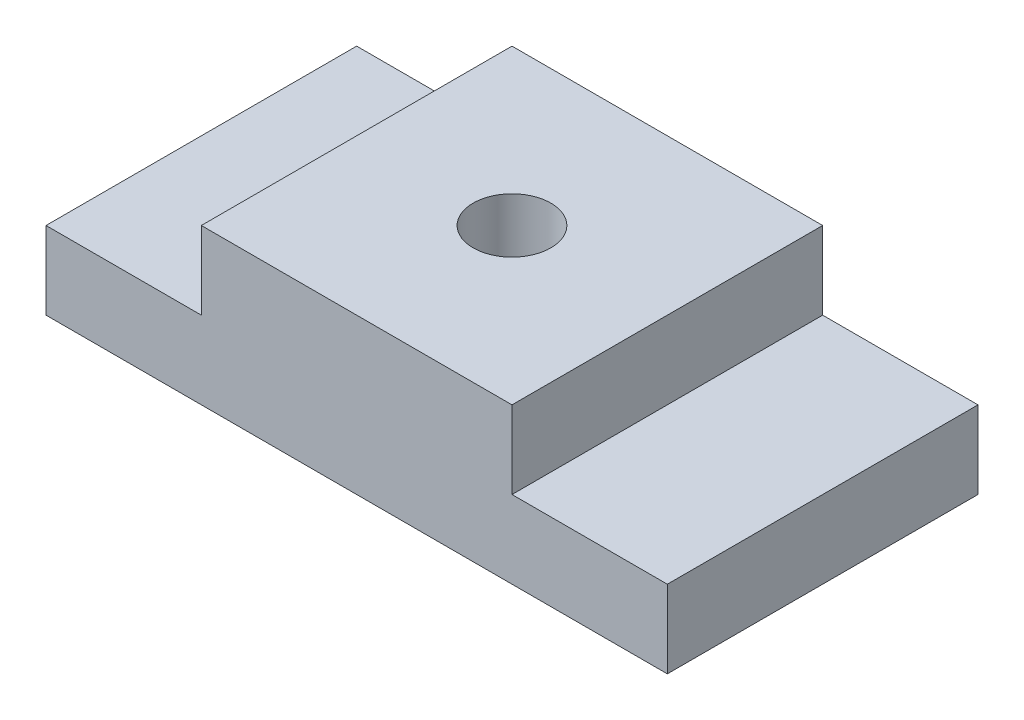
ISO-10303-21;
HEADER;
FILE_DESCRIPTION(('STEP AP214'),'2;1');
FILE_NAME('part.step','',(''),(''),'','','');
FILE_SCHEMA(('AUTOMOTIVE_DESIGN { 1 0 10303 214 1 1 1 1 }'));
ENDSEC;
DATA;
#1=APPLICATION_CONTEXT('core data for automotive mechanical design processes');
#2=APPLICATION_PROTOCOL_DEFINITION('international standard','automotive_design',2000,#1);
#3=PRODUCT_CONTEXT('',#1,'mechanical');
#4=PRODUCT('Part','Part','',(#3));
#5=PRODUCT_RELATED_PRODUCT_CATEGORY('part','',(#4));
#6=PRODUCT_DEFINITION_FORMATION('','',#4);
#7=PRODUCT_DEFINITION_CONTEXT('part definition',#1,'design');
#8=PRODUCT_DEFINITION('design','',#6,#7);
#9=PRODUCT_DEFINITION_SHAPE('','',#8);
#10=(LENGTH_UNIT() NAMED_UNIT(*) SI_UNIT(.MILLI.,.METRE.));
#11=(NAMED_UNIT(*) PLANE_ANGLE_UNIT() SI_UNIT($,.RADIAN.));
#12=(NAMED_UNIT(*) SI_UNIT($,.STERADIAN.) SOLID_ANGLE_UNIT());
#13=UNCERTAINTY_MEASURE_WITH_UNIT(LENGTH_MEASURE(1.E-05),#10,'distance_accuracy_value','');
#14=(GEOMETRIC_REPRESENTATION_CONTEXT(3) GLOBAL_UNCERTAINTY_ASSIGNED_CONTEXT((#13)) GLOBAL_UNIT_ASSIGNED_CONTEXT((#10,
#11,#12)) REPRESENTATION_CONTEXT('',''));
#15=CARTESIAN_POINT('',(0.,0.,0.));
#16=DIRECTION('',(0.,0.,1.));
#17=DIRECTION('',(1.,0.,0.));
#18=AXIS2_PLACEMENT_3D('',#15,#16,#17);
#19=CARTESIAN_POINT('',(0.,10.,0.));
#20=DIRECTION('',(0.,-1.,0.));
#21=DIRECTION('',(0.,0.,-1.));
#22=AXIS2_PLACEMENT_3D('',#19,#20,#21);
#23=PLANE('',#22);
#24=DIRECTION('',(0.,0.,-1.));
#25=VECTOR('',#24,1.);
#26=CARTESIAN_POINT('',(20.,10.,20.));
#27=LINE('',#26,#25);
#28=CARTESIAN_POINT('',(20.,10.,20.));
#29=VERTEX_POINT('',#28);
#30=CARTESIAN_POINT('',(20.,10.,-20.));
#31=VERTEX_POINT('',#30);
#32=EDGE_CURVE('E55',#29,#31,#27,.T.);
#33=ORIENTED_EDGE('',*,*,#32,.F.);
#34=DIRECTION('',(1.,0.,0.));
#35=VECTOR('',#34,1.);
#36=CARTESIAN_POINT('',(-40.,10.,20.));
#37=LINE('',#36,#35);
#38=CARTESIAN_POINT('',(40.,10.,20.));
#39=VERTEX_POINT('',#38);
#40=EDGE_CURVE('E152',#29,#39,#37,.T.);
#41=ORIENTED_EDGE('',*,*,#40,.T.);
#42=DIRECTION('',(0.,0.,-1.));
#43=VECTOR('',#42,1.);
#44=CARTESIAN_POINT('',(40.,10.,20.));
#45=LINE('',#44,#43);
#46=CARTESIAN_POINT('',(40.,10.,-20.));
#47=VERTEX_POINT('',#46);
#48=EDGE_CURVE('E140',#39,#47,#45,.T.);
#49=ORIENTED_EDGE('',*,*,#48,.T.);
#50=DIRECTION('',(-1.,0.,0.));
#51=VECTOR('',#50,1.);
#52=CARTESIAN_POINT('',(-40.,10.,-20.));
#53=LINE('',#52,#51);
#54=EDGE_CURVE('E146',#47,#31,#53,.T.);
#55=ORIENTED_EDGE('',*,*,#54,.T.);
#56=EDGE_LOOP('',(#33,#41,#49,#55));
#57=FACE_BOUND('',#56,.T.);
#58=ADVANCED_FACE('F39',(#57),#23,.F.);
#59=DIRECTION('',(0.,0.,1.));
#60=VECTOR('',#59,1.);
#61=CARTESIAN_POINT('',(-20.,10.,20.));
#62=LINE('',#61,#60);
#63=CARTESIAN_POINT('',(-20.,10.,-20.));
#64=VERTEX_POINT('',#63);
#65=CARTESIAN_POINT('',(-20.,10.,20.));
#66=VERTEX_POINT('',#65);
#67=EDGE_CURVE('E63',#64,#66,#62,.T.);
#68=ORIENTED_EDGE('',*,*,#67,.F.);
#69=CARTESIAN_POINT('',(-40.,10.,-20.));
#70=VERTEX_POINT('',#69);
#71=EDGE_CURVE('E144',#64,#70,#53,.T.);
#72=ORIENTED_EDGE('',*,*,#71,.T.);
#73=DIRECTION('',(0.,0.,1.));
#74=VECTOR('',#73,1.);
#75=CARTESIAN_POINT('',(-40.,10.,20.));
#76=LINE('',#75,#74);
#77=CARTESIAN_POINT('',(-40.,10.,20.));
#78=VERTEX_POINT('',#77);
#79=EDGE_CURVE('E149',#70,#78,#76,.T.);
#80=ORIENTED_EDGE('',*,*,#79,.T.);
#81=EDGE_CURVE('E153',#78,#66,#37,.T.);
#82=ORIENTED_EDGE('',*,*,#81,.T.);
#83=EDGE_LOOP('',(#68,#72,#80,#82));
#84=FACE_BOUND('',#83,.T.);
#85=ADVANCED_FACE('F191',(#84),#23,.F.);
#86=CARTESIAN_POINT('',(40.,10.,20.));
#87=DIRECTION('',(-1.,0.,0.));
#88=DIRECTION('',(0.,0.,1.));
#89=AXIS2_PLACEMENT_3D('',#86,#87,#88);
#90=PLANE('',#89);
#91=DIRECTION('',(0.,0.,-1.));
#92=VECTOR('',#91,1.);
#93=CARTESIAN_POINT('',(40.,0.,20.));
#94=LINE('',#93,#92);
#95=CARTESIAN_POINT('',(40.,0.,20.));
#96=VERTEX_POINT('',#95);
#97=CARTESIAN_POINT('',(40.,0.,-20.));
#98=VERTEX_POINT('',#97);
#99=EDGE_CURVE('E129',#96,#98,#94,.T.);
#100=ORIENTED_EDGE('',*,*,#99,.T.);
#101=DIRECTION('',(0.,-1.,0.));
#102=VECTOR('',#101,1.);
#103=CARTESIAN_POINT('',(40.,10.,-20.));
#104=LINE('',#103,#102);
#105=EDGE_CURVE('E11',#47,#98,#104,.T.);
#106=ORIENTED_EDGE('',*,*,#105,.F.);
#107=ORIENTED_EDGE('',*,*,#48,.F.);
#108=DIRECTION('',(0.,-1.,0.));
#109=VECTOR('',#108,1.);
#110=CARTESIAN_POINT('',(40.,10.,20.));
#111=LINE('',#110,#109);
#112=EDGE_CURVE('E155',#39,#96,#111,.T.);
#113=ORIENTED_EDGE('',*,*,#112,.T.);
#114=EDGE_LOOP('',(#100,#106,#107,#113));
#115=FACE_BOUND('',#114,.T.);
#116=ADVANCED_FACE('F41',(#115),#90,.F.);
#117=CARTESIAN_POINT('',(-40.,10.,-20.));
#118=DIRECTION('',(0.,0.,1.));
#119=DIRECTION('',(1.,0.,0.));
#120=AXIS2_PLACEMENT_3D('',#117,#118,#119);
#121=PLANE('',#120);
#122=DIRECTION('',(-1.,0.,0.));
#123=VECTOR('',#122,1.);
#124=CARTESIAN_POINT('',(-40.,0.,-20.));
#125=LINE('',#124,#123);
#126=CARTESIAN_POINT('',(-40.,0.,-20.));
#127=VERTEX_POINT('',#126);
#128=EDGE_CURVE('E134',#98,#127,#125,.T.);
#129=ORIENTED_EDGE('',*,*,#128,.T.);
#130=DIRECTION('',(0.,-1.,0.));
#131=VECTOR('',#130,1.);
#132=CARTESIAN_POINT('',(-40.,10.,-20.));
#133=LINE('',#132,#131);
#134=EDGE_CURVE('E48',#70,#127,#133,.T.);
#135=ORIENTED_EDGE('',*,*,#134,.F.);
#136=ORIENTED_EDGE('',*,*,#71,.F.);
#137=DIRECTION('',(0.,-1.,0.));
#138=VECTOR('',#137,1.);
#139=CARTESIAN_POINT('',(-20.,20.,-20.));
#140=LINE('',#139,#138);
#141=CARTESIAN_POINT('',(-20.,20.,-20.));
#142=VERTEX_POINT('',#141);
#143=EDGE_CURVE('E111',#142,#64,#140,.T.);
#144=ORIENTED_EDGE('',*,*,#143,.F.);
#145=DIRECTION('',(-1.,0.,0.));
#146=VECTOR('',#145,1.);
#147=CARTESIAN_POINT('',(-20.,20.,-20.));
#148=LINE('',#147,#146);
#149=CARTESIAN_POINT('',(20.,20.,-20.));
#150=VERTEX_POINT('',#149);
#151=EDGE_CURVE('E105',#150,#142,#148,.T.);
#152=ORIENTED_EDGE('',*,*,#151,.F.);
#153=DIRECTION('',(0.,-1.,0.));
#154=VECTOR('',#153,1.);
#155=CARTESIAN_POINT('',(20.,20.,-20.));
#156=LINE('',#155,#154);
#157=EDGE_CURVE('E109',#150,#31,#156,.T.);
#158=ORIENTED_EDGE('',*,*,#157,.T.);
#159=ORIENTED_EDGE('',*,*,#54,.F.);
#160=ORIENTED_EDGE('',*,*,#105,.T.);
#161=EDGE_LOOP('',(#129,#135,#136,#144,#152,#158,#159,#160));
#162=FACE_BOUND('',#161,.T.);
#163=ADVANCED_FACE('F107',(#162),#121,.F.);
#164=CARTESIAN_POINT('',(-40.,10.,20.));
#165=DIRECTION('',(1.,0.,0.));
#166=DIRECTION('',(0.,0.,-1.));
#167=AXIS2_PLACEMENT_3D('',#164,#165,#166);
#168=PLANE('',#167);
#169=DIRECTION('',(0.,0.,1.));
#170=VECTOR('',#169,1.);
#171=CARTESIAN_POINT('',(-40.,0.,20.));
#172=LINE('',#171,#170);
#173=CARTESIAN_POINT('',(-40.,0.,20.));
#174=VERTEX_POINT('',#173);
#175=EDGE_CURVE('E159',#127,#174,#172,.T.);
#176=ORIENTED_EDGE('',*,*,#175,.T.);
#177=DIRECTION('',(0.,-1.,0.));
#178=VECTOR('',#177,1.);
#179=CARTESIAN_POINT('',(-40.,10.,20.));
#180=LINE('',#179,#178);
#181=EDGE_CURVE('E167',#78,#174,#180,.T.);
#182=ORIENTED_EDGE('',*,*,#181,.F.);
#183=ORIENTED_EDGE('',*,*,#79,.F.);
#184=ORIENTED_EDGE('',*,*,#134,.T.);
#185=EDGE_LOOP('',(#176,#182,#183,#184));
#186=FACE_BOUND('',#185,.T.);
#187=ADVANCED_FACE('F176',(#186),#168,.F.);
#188=CARTESIAN_POINT('',(-40.,10.,20.));
#189=DIRECTION('',(0.,0.,-1.));
#190=DIRECTION('',(-1.,0.,0.));
#191=AXIS2_PLACEMENT_3D('',#188,#189,#190);
#192=PLANE('',#191);
#193=DIRECTION('',(1.,0.,0.));
#194=VECTOR('',#193,1.);
#195=CARTESIAN_POINT('',(-40.,0.,20.));
#196=LINE('',#195,#194);
#197=EDGE_CURVE('E145',#174,#96,#196,.T.);
#198=ORIENTED_EDGE('',*,*,#197,.T.);
#199=ORIENTED_EDGE('',*,*,#112,.F.);
#200=ORIENTED_EDGE('',*,*,#40,.F.);
#201=DIRECTION('',(0.,-1.,0.));
#202=VECTOR('',#201,1.);
#203=CARTESIAN_POINT('',(20.,20.,20.));
#204=LINE('',#203,#202);
#205=CARTESIAN_POINT('',(20.,20.,20.));
#206=VERTEX_POINT('',#205);
#207=EDGE_CURVE('E199',#206,#29,#204,.T.);
#208=ORIENTED_EDGE('',*,*,#207,.F.);
#209=DIRECTION('',(1.,0.,0.));
#210=VECTOR('',#209,1.);
#211=CARTESIAN_POINT('',(-20.,20.,20.));
#212=LINE('',#211,#210);
#213=CARTESIAN_POINT('',(-20.,20.,20.));
#214=VERTEX_POINT('',#213);
#215=EDGE_CURVE('E121',#214,#206,#212,.T.);
#216=ORIENTED_EDGE('',*,*,#215,.F.);
#217=DIRECTION('',(0.,-1.,0.));
#218=VECTOR('',#217,1.);
#219=CARTESIAN_POINT('',(-20.,20.,20.));
#220=LINE('',#219,#218);
#221=EDGE_CURVE('E136',#214,#66,#220,.T.);
#222=ORIENTED_EDGE('',*,*,#221,.T.);
#223=ORIENTED_EDGE('',*,*,#81,.F.);
#224=ORIENTED_EDGE('',*,*,#181,.T.);
#225=EDGE_LOOP('',(#198,#199,#200,#208,#216,#222,#223,#224));
#226=FACE_BOUND('',#225,.T.);
#227=ADVANCED_FACE('F184',(#226),#192,.F.);
#228=CARTESIAN_POINT('',(0.,0.,0.));
#229=DIRECTION('',(0.,-1.,0.));
#230=DIRECTION('',(0.,0.,-1.));
#231=AXIS2_PLACEMENT_3D('',#228,#229,#230);
#232=PLANE('',#231);
#233=ORIENTED_EDGE('',*,*,#99,.F.);
#234=ORIENTED_EDGE('',*,*,#197,.F.);
#235=ORIENTED_EDGE('',*,*,#175,.F.);
#236=ORIENTED_EDGE('',*,*,#128,.F.);
#237=EDGE_LOOP('',(#233,#234,#235,#236));
#238=FACE_BOUND('',#237,.T.);
#239=ADVANCED_FACE('F181',(#238),#232,.T.);
#240=CARTESIAN_POINT('',(20.,20.,20.));
#241=DIRECTION('',(-1.,0.,0.));
#242=DIRECTION('',(0.,0.,1.));
#243=AXIS2_PLACEMENT_3D('',#240,#241,#242);
#244=PLANE('',#243);
#245=ORIENTED_EDGE('',*,*,#32,.T.);
#246=ORIENTED_EDGE('',*,*,#157,.F.);
#247=DIRECTION('',(0.,0.,-1.));
#248=VECTOR('',#247,1.);
#249=CARTESIAN_POINT('',(20.,20.,20.));
#250=LINE('',#249,#248);
#251=EDGE_CURVE('E116',#206,#150,#250,.T.);
#252=ORIENTED_EDGE('',*,*,#251,.F.);
#253=ORIENTED_EDGE('',*,*,#207,.T.);
#254=EDGE_LOOP('',(#245,#246,#252,#253));
#255=FACE_BOUND('',#254,.T.);
#256=ADVANCED_FACE('F127',(#255),#244,.F.);
#257=CARTESIAN_POINT('',(-20.,20.,20.));
#258=DIRECTION('',(1.,0.,0.));
#259=DIRECTION('',(0.,0.,-1.));
#260=AXIS2_PLACEMENT_3D('',#257,#258,#259);
#261=PLANE('',#260);
#262=ORIENTED_EDGE('',*,*,#67,.T.);
#263=ORIENTED_EDGE('',*,*,#221,.F.);
#264=DIRECTION('',(0.,0.,1.));
#265=VECTOR('',#264,1.);
#266=CARTESIAN_POINT('',(-20.,20.,20.));
#267=LINE('',#266,#265);
#268=EDGE_CURVE('E115',#142,#214,#267,.T.);
#269=ORIENTED_EDGE('',*,*,#268,.F.);
#270=ORIENTED_EDGE('',*,*,#143,.T.);
#271=EDGE_LOOP('',(#262,#263,#269,#270));
#272=FACE_BOUND('',#271,.T.);
#273=ADVANCED_FACE('F193',(#272),#261,.F.);
#274=CARTESIAN_POINT('',(0.,20.,0.));
#275=DIRECTION('',(0.,-1.,0.));
#276=DIRECTION('',(0.,0.,-1.));
#277=AXIS2_PLACEMENT_3D('',#274,#275,#276);
#278=PLANE('',#277);
#279=CARTESIAN_POINT('',(0.,20.,0.));
#280=DIRECTION('',(0.,1.,0.));
#281=DIRECTION('',(0.,0.,1.));
#282=AXIS2_PLACEMENT_3D('',#279,#280,#281);
#283=CIRCLE('',#282,5.);
#284=CARTESIAN_POINT('',(0.,20.,5.));
#285=VERTEX_POINT('',#284);
#286=EDGE_CURVE('E212',#285,#285,#283,.T.);
#287=ORIENTED_EDGE('',*,*,#286,.F.);
#288=EDGE_LOOP('',(#287));
#289=FACE_BOUND('',#288,.T.);
#290=ORIENTED_EDGE('',*,*,#251,.T.);
#291=ORIENTED_EDGE('',*,*,#151,.T.);
#292=ORIENTED_EDGE('',*,*,#268,.T.);
#293=ORIENTED_EDGE('',*,*,#215,.T.);
#294=EDGE_LOOP('',(#290,#291,#292,#293));
#295=FACE_BOUND('',#294,.T.);
#296=ADVANCED_FACE('F119',(#289,#295),#278,.F.);
#297=CARTESIAN_POINT('',(0.,10.,0.));
#298=DIRECTION('',(0.,1.,0.));
#299=DIRECTION('',(0.,0.,1.));
#300=AXIS2_PLACEMENT_3D('',#297,#298,#299);
#301=CYLINDRICAL_SURFACE('',#300,5.);
#302=CARTESIAN_POINT('',(0.,10.,0.));
#303=DIRECTION('',(0.,1.,0.));
#304=DIRECTION('',(0.,0.,1.));
#305=AXIS2_PLACEMENT_3D('',#302,#303,#304);
#306=CIRCLE('',#305,5.);
#307=CARTESIAN_POINT('',(0.,10.,5.));
#308=VERTEX_POINT('',#307);
#309=EDGE_CURVE('E204',#308,#308,#306,.T.);
#310=ORIENTED_EDGE('',*,*,#309,.F.);
#311=EDGE_LOOP('',(#310));
#312=FACE_BOUND('',#311,.T.);
#313=ORIENTED_EDGE('',*,*,#286,.T.);
#314=EDGE_LOOP('',(#313));
#315=FACE_BOUND('',#314,.T.);
#316=ADVANCED_FACE('F218',(#312,#315),#301,.F.);
#317=CARTESIAN_POINT('',(0.,10.,0.));
#318=DIRECTION('',(0.,1.,0.));
#319=DIRECTION('',(0.,0.,1.));
#320=AXIS2_PLACEMENT_3D('',#317,#318,#319);
#321=PLANE('',#320);
#322=ORIENTED_EDGE('',*,*,#309,.T.);
#323=EDGE_LOOP('',(#322));
#324=FACE_BOUND('',#323,.T.);
#325=ADVANCED_FACE('F226',(#324),#321,.T.);
#326=CLOSED_SHELL('',(#58,#85,#116,#163,#187,#227,#239,#256,#273,#296,#316,#325));
#327=MANIFOLD_SOLID_BREP('B2',#326);
#328=ADVANCED_BREP_SHAPE_REPRESENTATION('',(#18,#327),#14);
#329=SHAPE_DEFINITION_REPRESENTATION(#9,#328);
ENDSEC;
END-ISO-10303-21;
